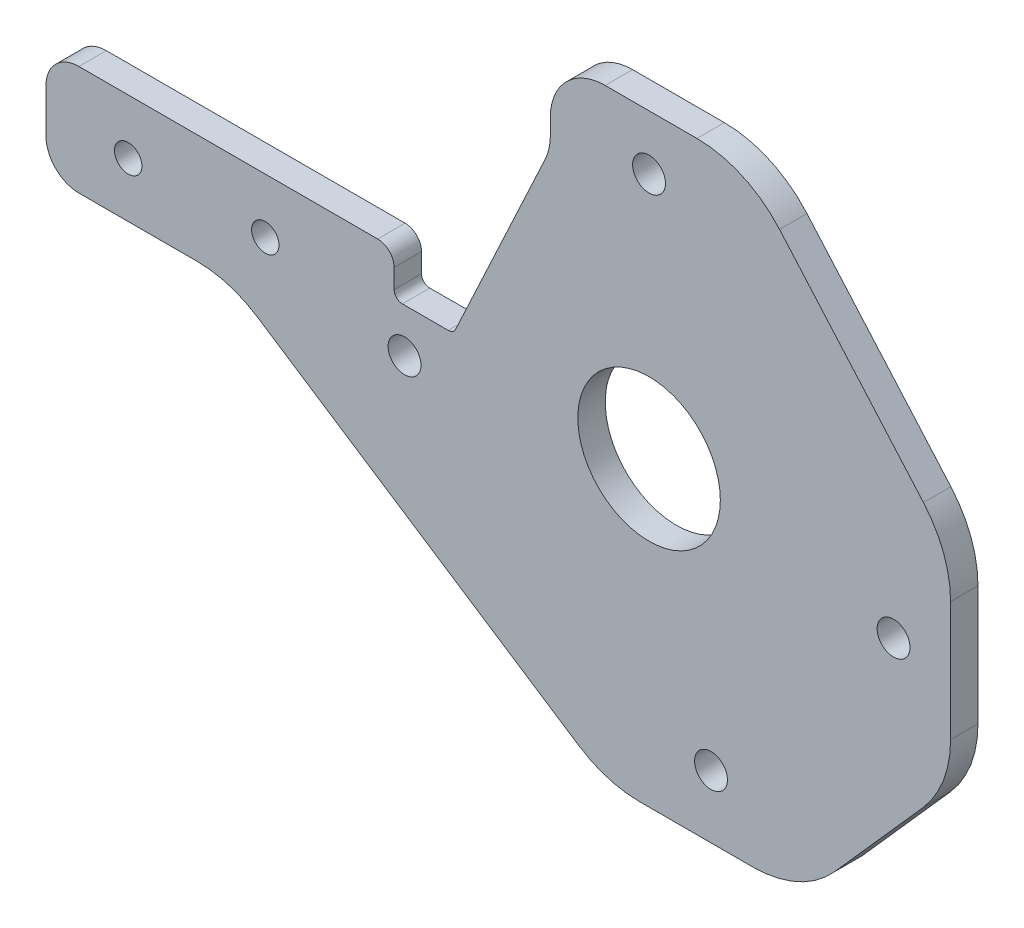
ISO-10303-21;
HEADER;
FILE_DESCRIPTION(('STEP AP214'),'2;1');
FILE_NAME('part.step','',(''),(''),'','','');
FILE_SCHEMA(('AUTOMOTIVE_DESIGN { 1 0 10303 214 1 1 1 1 }'));
ENDSEC;
DATA;
#1=APPLICATION_CONTEXT('core data for automotive mechanical design processes');
#2=APPLICATION_PROTOCOL_DEFINITION('international standard','automotive_design',2000,#1);
#3=PRODUCT_CONTEXT('',#1,'mechanical');
#4=PRODUCT('Part','Part','',(#3));
#5=PRODUCT_RELATED_PRODUCT_CATEGORY('part','',(#4));
#6=PRODUCT_DEFINITION_FORMATION('','',#4);
#7=PRODUCT_DEFINITION_CONTEXT('part definition',#1,'design');
#8=PRODUCT_DEFINITION('design','',#6,#7);
#9=PRODUCT_DEFINITION_SHAPE('','',#8);
#10=(LENGTH_UNIT() NAMED_UNIT(*) SI_UNIT(.MILLI.,.METRE.));
#11=(NAMED_UNIT(*) PLANE_ANGLE_UNIT() SI_UNIT($,.RADIAN.));
#12=(NAMED_UNIT(*) SI_UNIT($,.STERADIAN.) SOLID_ANGLE_UNIT());
#13=UNCERTAINTY_MEASURE_WITH_UNIT(LENGTH_MEASURE(1.E-05),#10,'distance_accuracy_value','');
#14=(GEOMETRIC_REPRESENTATION_CONTEXT(3) GLOBAL_UNCERTAINTY_ASSIGNED_CONTEXT((#13)) GLOBAL_UNIT_ASSIGNED_CONTEXT((#10,
#11,#12)) REPRESENTATION_CONTEXT('',''));
#15=CARTESIAN_POINT('',(0.,0.,0.));
#16=DIRECTION('',(0.,0.,1.));
#17=DIRECTION('',(1.,0.,0.));
#18=AXIS2_PLACEMENT_3D('',#15,#16,#17);
#19=CARTESIAN_POINT('',(0.,-10.,2.5));
#20=DIRECTION('',(0.,1.,0.));
#21=DIRECTION('',(0.,0.,1.));
#22=AXIS2_PLACEMENT_3D('',#19,#20,#21);
#23=PLANE('',#22);
#24=DIRECTION('',(1.,0.,0.));
#25=VECTOR('',#24,1.);
#26=CARTESIAN_POINT('',(0.,-10.,2.5));
#27=LINE('',#26,#25);
#28=CARTESIAN_POINT('',(-104.,-10.,2.5));
#29=VERTEX_POINT('',#28);
#30=CARTESIAN_POINT('',(-82.4582213056563,-10.,2.5));
#31=VERTEX_POINT('',#30);
#32=EDGE_CURVE('E297',#29,#31,#27,.T.);
#33=ORIENTED_EDGE('',*,*,#32,.F.);
#34=DIRECTION('',(0.,0.,-1.));
#35=VECTOR('',#34,1.);
#36=CARTESIAN_POINT('',(-104.,-10.,2.5));
#37=LINE('',#36,#35);
#38=CARTESIAN_POINT('',(-104.,-10.,-2.5));
#39=VERTEX_POINT('',#38);
#40=EDGE_CURVE('E403',#29,#39,#37,.T.);
#41=ORIENTED_EDGE('',*,*,#40,.T.);
#42=DIRECTION('',(1.,0.,0.));
#43=VECTOR('',#42,1.);
#44=CARTESIAN_POINT('',(0.,-10.,-2.5));
#45=LINE('',#44,#43);
#46=CARTESIAN_POINT('',(-82.4582213056563,-10.,-2.5));
#47=VERTEX_POINT('',#46);
#48=EDGE_CURVE('E330',#39,#47,#45,.T.);
#49=ORIENTED_EDGE('',*,*,#48,.T.);
#50=DIRECTION('',(0.,0.,-1.));
#51=VECTOR('',#50,1.);
#52=CARTESIAN_POINT('',(-82.4582213056563,-10.,2.5));
#53=LINE('',#52,#51);
#54=EDGE_CURVE('E340',#47,#31,#53,.F.);
#55=ORIENTED_EDGE('',*,*,#54,.T.);
#56=EDGE_LOOP('',(#33,#41,#49,#55));
#57=FACE_BOUND('',#56,.T.);
#58=ADVANCED_FACE('F39',(#57),#23,.F.);
#59=CARTESIAN_POINT('',(0.,10.,2.5));
#60=DIRECTION('',(0.,-1.,0.));
#61=DIRECTION('',(1.,0.,0.));
#62=AXIS2_PLACEMENT_3D('',#59,#60,#61);
#63=PLANE('',#62);
#64=DIRECTION('',(-1.,0.,0.));
#65=VECTOR('',#64,1.);
#66=CARTESIAN_POINT('',(0.,10.,2.5));
#67=LINE('',#66,#65);
#68=CARTESIAN_POINT('',(-49.5,10.,2.5));
#69=VERTEX_POINT('',#68);
#70=CARTESIAN_POINT('',(-104.,9.99999999999999,2.5));
#71=VERTEX_POINT('',#70);
#72=EDGE_CURVE('E292',#69,#71,#67,.T.);
#73=ORIENTED_EDGE('',*,*,#72,.F.);
#74=DIRECTION('',(0.,0.,1.));
#75=VECTOR('',#74,1.);
#76=CARTESIAN_POINT('',(-49.5,10.,2.5));
#77=LINE('',#76,#75);
#78=CARTESIAN_POINT('',(-49.5,10.,-2.5));
#79=VERTEX_POINT('',#78);
#80=EDGE_CURVE('E431',#69,#79,#77,.F.);
#81=ORIENTED_EDGE('',*,*,#80,.T.);
#82=DIRECTION('',(-1.,0.,0.));
#83=VECTOR('',#82,1.);
#84=CARTESIAN_POINT('',(0.,10.,-2.5));
#85=LINE('',#84,#83);
#86=CARTESIAN_POINT('',(-104.,9.99999999999999,-2.5));
#87=VERTEX_POINT('',#86);
#88=EDGE_CURVE('E325',#79,#87,#85,.T.);
#89=ORIENTED_EDGE('',*,*,#88,.T.);
#90=DIRECTION('',(0.,0.,-1.));
#91=VECTOR('',#90,1.);
#92=CARTESIAN_POINT('',(-104.,9.99999999999999,2.5));
#93=LINE('',#92,#91);
#94=EDGE_CURVE('E396',#87,#71,#93,.F.);
#95=ORIENTED_EDGE('',*,*,#94,.T.);
#96=EDGE_LOOP('',(#73,#81,#89,#95));
#97=FACE_BOUND('',#96,.T.);
#98=ADVANCED_FACE('F476',(#97),#63,.F.);
#99=CARTESIAN_POINT('',(-110.,0.,2.5));
#100=DIRECTION('',(1.,0.,0.));
#101=DIRECTION('',(0.,1.,0.));
#102=AXIS2_PLACEMENT_3D('',#99,#100,#101);
#103=PLANE('',#102);
#104=DIRECTION('',(0.,-1.,0.));
#105=VECTOR('',#104,1.);
#106=CARTESIAN_POINT('',(-110.,0.,2.5));
#107=LINE('',#106,#105);
#108=CARTESIAN_POINT('',(-110.,3.99999999999999,2.5));
#109=VERTEX_POINT('',#108);
#110=CARTESIAN_POINT('',(-110.,-4.00000000000001,2.5));
#111=VERTEX_POINT('',#110);
#112=EDGE_CURVE('E294',#109,#111,#107,.T.);
#113=ORIENTED_EDGE('',*,*,#112,.F.);
#114=DIRECTION('',(0.,0.,-1.));
#115=VECTOR('',#114,1.);
#116=CARTESIAN_POINT('',(-110.,3.99999999999999,2.5));
#117=LINE('',#116,#115);
#118=CARTESIAN_POINT('',(-110.,3.99999999999999,-2.5));
#119=VERTEX_POINT('',#118);
#120=EDGE_CURVE('E388',#109,#119,#117,.T.);
#121=ORIENTED_EDGE('',*,*,#120,.T.);
#122=DIRECTION('',(0.,-1.,0.));
#123=VECTOR('',#122,1.);
#124=CARTESIAN_POINT('',(-110.,0.,-2.5));
#125=LINE('',#124,#123);
#126=CARTESIAN_POINT('',(-110.,-4.00000000000001,-2.5));
#127=VERTEX_POINT('',#126);
#128=EDGE_CURVE('E327',#119,#127,#125,.T.);
#129=ORIENTED_EDGE('',*,*,#128,.T.);
#130=DIRECTION('',(0.,0.,-1.));
#131=VECTOR('',#130,1.);
#132=CARTESIAN_POINT('',(-110.,-4.00000000000001,2.5));
#133=LINE('',#132,#131);
#134=EDGE_CURVE('E386',#127,#111,#133,.F.);
#135=ORIENTED_EDGE('',*,*,#134,.T.);
#136=EDGE_LOOP('',(#113,#121,#129,#135));
#137=FACE_BOUND('',#136,.T.);
#138=ADVANCED_FACE('F485',(#137),#103,.F.);
#139=CARTESIAN_POINT('',(0.,-55.,2.5));
#140=DIRECTION('',(0.,1.,0.));
#141=DIRECTION('',(0.,0.,1.));
#142=AXIS2_PLACEMENT_3D('',#139,#140,#141);
#143=PLANE('',#142);
#144=DIRECTION('',(1.,0.,0.));
#145=VECTOR('',#144,1.);
#146=CARTESIAN_POINT('',(0.,-55.,2.5));
#147=LINE('',#146,#145);
#148=CARTESIAN_POINT('',(-1.77605476291935,-55.,2.5));
#149=VERTEX_POINT('',#148);
#150=CARTESIAN_POINT('',(18.8874431024964,-55.,2.5));
#151=VERTEX_POINT('',#150);
#152=EDGE_CURVE('E299',#149,#151,#147,.T.);
#153=ORIENTED_EDGE('',*,*,#152,.F.);
#154=DIRECTION('',(0.,0.,1.));
#155=VECTOR('',#154,1.);
#156=CARTESIAN_POINT('',(-1.77605476291935,-55.,2.5));
#157=LINE('',#156,#155);
#158=CARTESIAN_POINT('',(-1.77605476291935,-55.,-2.5));
#159=VERTEX_POINT('',#158);
#160=EDGE_CURVE('E217',#149,#159,#157,.F.);
#161=ORIENTED_EDGE('',*,*,#160,.T.);
#162=DIRECTION('',(1.,0.,0.));
#163=VECTOR('',#162,1.);
#164=CARTESIAN_POINT('',(0.,-55.,-2.5));
#165=LINE('',#164,#163);
#166=CARTESIAN_POINT('',(18.8874431024964,-55.,-2.5));
#167=VERTEX_POINT('',#166);
#168=EDGE_CURVE('E332',#159,#167,#165,.T.);
#169=ORIENTED_EDGE('',*,*,#168,.T.);
#170=DIRECTION('',(0.,0.,1.));
#171=VECTOR('',#170,1.);
#172=CARTESIAN_POINT('',(18.8874431024964,-55.,2.5));
#173=LINE('',#172,#171);
#174=EDGE_CURVE('E221',#167,#151,#173,.T.);
#175=ORIENTED_EDGE('',*,*,#174,.T.);
#176=EDGE_LOOP('',(#153,#161,#169,#175));
#177=FACE_BOUND('',#176,.T.);
#178=ADVANCED_FACE('F501',(#177),#143,.F.);
#179=CARTESIAN_POINT('',(55.,0.,2.5));
#180=DIRECTION('',(-1.,0.,0.));
#181=DIRECTION('',(0.,0.,1.));
#182=AXIS2_PLACEMENT_3D('',#179,#180,#181);
#183=PLANE('',#182);
#184=DIRECTION('',(0.,1.,0.));
#185=VECTOR('',#184,1.);
#186=CARTESIAN_POINT('',(55.,0.,2.5));
#187=LINE('',#186,#185);
#188=CARTESIAN_POINT('',(55.,-16.8261267667128,2.5));
#189=VERTEX_POINT('',#188);
#190=CARTESIAN_POINT('',(55.,4.97596875721935,2.5));
#191=VERTEX_POINT('',#190);
#192=EDGE_CURVE('E301',#189,#191,#187,.T.);
#193=ORIENTED_EDGE('',*,*,#192,.F.);
#194=DIRECTION('',(0.,0.,1.));
#195=VECTOR('',#194,1.);
#196=CARTESIAN_POINT('',(55.,-16.8261267667128,2.5));
#197=LINE('',#196,#195);
#198=CARTESIAN_POINT('',(55.,-16.8261267667128,-2.5));
#199=VERTEX_POINT('',#198);
#200=EDGE_CURVE('E372',#189,#199,#197,.F.);
#201=ORIENTED_EDGE('',*,*,#200,.T.);
#202=DIRECTION('',(0.,1.,0.));
#203=VECTOR('',#202,1.);
#204=CARTESIAN_POINT('',(55.,0.,-2.5));
#205=LINE('',#204,#203);
#206=CARTESIAN_POINT('',(55.,4.97596875721935,-2.5));
#207=VERTEX_POINT('',#206);
#208=EDGE_CURVE('E335',#199,#207,#205,.T.);
#209=ORIENTED_EDGE('',*,*,#208,.T.);
#210=DIRECTION('',(0.,0.,1.));
#211=VECTOR('',#210,1.);
#212=CARTESIAN_POINT('',(55.,4.97596875721935,2.5));
#213=LINE('',#212,#211);
#214=EDGE_CURVE('E369',#207,#191,#213,.T.);
#215=ORIENTED_EDGE('',*,*,#214,.T.);
#216=EDGE_LOOP('',(#193,#201,#209,#215));
#217=FACE_BOUND('',#216,.T.);
#218=ADVANCED_FACE('F530',(#217),#183,.F.);
#219=CARTESIAN_POINT('',(0.,44.9999999999999,2.5));
#220=DIRECTION('',(0.,0.,-1.));
#221=DIRECTION('',(-1.,0.,0.));
#222=AXIS2_PLACEMENT_3D('',#219,#220,#221);
#223=CYLINDRICAL_SURFACE('',#222,3.00000000000001);
#224=CARTESIAN_POINT('',(0.,44.9999999999999,2.5));
#225=DIRECTION('',(0.,0.,1.));
#226=DIRECTION('',(1.,0.,0.));
#227=AXIS2_PLACEMENT_3D('',#224,#225,#226);
#228=CIRCLE('',#227,3.00000000000001);
#229=CARTESIAN_POINT('',(3.00000000000001,44.9999999999999,2.5));
#230=VERTEX_POINT('',#229);
#231=EDGE_CURVE('E289',#230,#230,#228,.T.);
#232=ORIENTED_EDGE('',*,*,#231,.T.);
#233=EDGE_LOOP('',(#232));
#234=FACE_BOUND('',#233,.T.);
#235=CARTESIAN_POINT('',(0.,44.9999999999999,-2.5));
#236=DIRECTION('',(0.,0.,1.));
#237=DIRECTION('',(1.,0.,0.));
#238=AXIS2_PLACEMENT_3D('',#235,#236,#237);
#239=CIRCLE('',#238,3.00000000000001);
#240=CARTESIAN_POINT('',(3.00000000000001,44.9999999999999,-2.5));
#241=VERTEX_POINT('',#240);
#242=EDGE_CURVE('E322',#241,#241,#239,.T.);
#243=ORIENTED_EDGE('',*,*,#242,.F.);
#244=EDGE_LOOP('',(#243));
#245=FACE_BOUND('',#244,.T.);
#246=ADVANCED_FACE('F554',(#234,#245),#223,.F.);
#247=CARTESIAN_POINT('',(-44.5982062419555,-6.00000000000005,2.5));
#248=DIRECTION('',(0.,0.,-1.));
#249=DIRECTION('',(-1.,0.,0.));
#250=AXIS2_PLACEMENT_3D('',#247,#248,#249);
#251=CYLINDRICAL_SURFACE('',#250,2.99999999999999);
#252=CARTESIAN_POINT('',(-44.5982062419555,-6.00000000000005,2.5));
#253=DIRECTION('',(0.,0.,1.));
#254=DIRECTION('',(1.,0.,0.));
#255=AXIS2_PLACEMENT_3D('',#252,#253,#254);
#256=CIRCLE('',#255,2.99999999999999);
#257=CARTESIAN_POINT('',(-41.5982062419555,-6.00000000000005,2.5));
#258=VERTEX_POINT('',#257);
#259=EDGE_CURVE('E286',#258,#258,#256,.T.);
#260=ORIENTED_EDGE('',*,*,#259,.T.);
#261=EDGE_LOOP('',(#260));
#262=FACE_BOUND('',#261,.T.);
#263=CARTESIAN_POINT('',(-44.5982062419555,-6.00000000000005,-2.5));
#264=DIRECTION('',(0.,0.,1.));
#265=DIRECTION('',(1.,0.,0.));
#266=AXIS2_PLACEMENT_3D('',#263,#264,#265);
#267=CIRCLE('',#266,2.99999999999999);
#268=CARTESIAN_POINT('',(-41.5982062419555,-6.00000000000005,-2.5));
#269=VERTEX_POINT('',#268);
#270=EDGE_CURVE('E319',#269,#269,#267,.T.);
#271=ORIENTED_EDGE('',*,*,#270,.F.);
#272=EDGE_LOOP('',(#271));
#273=FACE_BOUND('',#272,.T.);
#274=ADVANCED_FACE('F557',(#262,#273),#251,.F.);
#275=CARTESIAN_POINT('',(44.5982062419555,-6.00000000000005,2.5));
#276=DIRECTION('',(0.,0.,-1.));
#277=DIRECTION('',(-1.,0.,0.));
#278=AXIS2_PLACEMENT_3D('',#275,#276,#277);
#279=CYLINDRICAL_SURFACE('',#278,3.);
#280=CARTESIAN_POINT('',(44.5982062419555,-6.00000000000005,2.5));
#281=DIRECTION('',(0.,0.,1.));
#282=DIRECTION('',(1.,0.,0.));
#283=AXIS2_PLACEMENT_3D('',#280,#281,#282);
#284=CIRCLE('',#283,3.);
#285=CARTESIAN_POINT('',(47.5982062419555,-6.00000000000005,2.5));
#286=VERTEX_POINT('',#285);
#287=EDGE_CURVE('E283',#286,#286,#284,.T.);
#288=ORIENTED_EDGE('',*,*,#287,.T.);
#289=EDGE_LOOP('',(#288));
#290=FACE_BOUND('',#289,.T.);
#291=CARTESIAN_POINT('',(44.5982062419555,-6.00000000000005,-2.5));
#292=DIRECTION('',(0.,0.,1.));
#293=DIRECTION('',(1.,0.,0.));
#294=AXIS2_PLACEMENT_3D('',#291,#292,#293);
#295=CIRCLE('',#294,3.);
#296=CARTESIAN_POINT('',(47.5982062419555,-6.00000000000005,-2.5));
#297=VERTEX_POINT('',#296);
#298=EDGE_CURVE('E316',#297,#297,#295,.T.);
#299=ORIENTED_EDGE('',*,*,#298,.F.);
#300=EDGE_LOOP('',(#299));
#301=FACE_BOUND('',#300,.T.);
#302=ADVANCED_FACE('F561',(#290,#301),#279,.F.);
#303=CARTESIAN_POINT('',(11.3,-43.5581220899157,2.5));
#304=DIRECTION('',(0.,0.,-1.));
#305=DIRECTION('',(-1.,0.,0.));
#306=AXIS2_PLACEMENT_3D('',#303,#304,#305);
#307=CYLINDRICAL_SURFACE('',#306,3.00000000000001);
#308=CARTESIAN_POINT('',(11.3,-43.5581220899157,2.5));
#309=DIRECTION('',(0.,0.,1.));
#310=DIRECTION('',(1.,0.,0.));
#311=AXIS2_PLACEMENT_3D('',#308,#309,#310);
#312=CIRCLE('',#311,3.00000000000001);
#313=CARTESIAN_POINT('',(14.3,-43.5581220899157,2.5));
#314=VERTEX_POINT('',#313);
#315=EDGE_CURVE('E280',#314,#314,#312,.T.);
#316=ORIENTED_EDGE('',*,*,#315,.T.);
#317=EDGE_LOOP('',(#316));
#318=FACE_BOUND('',#317,.T.);
#319=CARTESIAN_POINT('',(11.3,-43.5581220899157,-2.5));
#320=DIRECTION('',(0.,0.,1.));
#321=DIRECTION('',(1.,0.,0.));
#322=AXIS2_PLACEMENT_3D('',#319,#320,#321);
#323=CIRCLE('',#322,3.00000000000001);
#324=CARTESIAN_POINT('',(14.3,-43.5581220899157,-2.5));
#325=VERTEX_POINT('',#324);
#326=EDGE_CURVE('E313',#325,#325,#323,.T.);
#327=ORIENTED_EDGE('',*,*,#326,.F.);
#328=EDGE_LOOP('',(#327));
#329=FACE_BOUND('',#328,.T.);
#330=ADVANCED_FACE('F565',(#318,#329),#307,.F.);
#331=CARTESIAN_POINT('',(0.,0.,2.5));
#332=DIRECTION('',(0.,0.,-1.));
#333=DIRECTION('',(-1.,0.,0.));
#334=AXIS2_PLACEMENT_3D('',#331,#332,#333);
#335=CYLINDRICAL_SURFACE('',#334,13.);
#336=CARTESIAN_POINT('',(0.,0.,2.5));
#337=DIRECTION('',(0.,0.,1.));
#338=DIRECTION('',(1.,0.,0.));
#339=AXIS2_PLACEMENT_3D('',#336,#337,#338);
#340=CIRCLE('',#339,13.);
#341=CARTESIAN_POINT('',(13.,0.,2.5));
#342=VERTEX_POINT('',#341);
#343=EDGE_CURVE('E277',#342,#342,#340,.T.);
#344=ORIENTED_EDGE('',*,*,#343,.T.);
#345=EDGE_LOOP('',(#344));
#346=FACE_BOUND('',#345,.T.);
#347=CARTESIAN_POINT('',(0.,0.,-2.5));
#348=DIRECTION('',(0.,0.,1.));
#349=DIRECTION('',(1.,0.,0.));
#350=AXIS2_PLACEMENT_3D('',#347,#348,#349);
#351=CIRCLE('',#350,13.);
#352=CARTESIAN_POINT('',(13.,0.,-2.5));
#353=VERTEX_POINT('',#352);
#354=EDGE_CURVE('E310',#353,#353,#351,.T.);
#355=ORIENTED_EDGE('',*,*,#354,.F.);
#356=EDGE_LOOP('',(#355));
#357=FACE_BOUND('',#356,.T.);
#358=ADVANCED_FACE('F569',(#346,#357),#335,.F.);
#359=CARTESIAN_POINT('',(-95.,0.,2.5));
#360=DIRECTION('',(0.,0.,-1.));
#361=DIRECTION('',(-1.,0.,0.));
#362=AXIS2_PLACEMENT_3D('',#359,#360,#361);
#363=CYLINDRICAL_SURFACE('',#362,2.50000000000001);
#364=CARTESIAN_POINT('',(-95.,0.,2.5));
#365=DIRECTION('',(0.,0.,1.));
#366=DIRECTION('',(1.,0.,0.));
#367=AXIS2_PLACEMENT_3D('',#364,#365,#366);
#368=CIRCLE('',#367,2.50000000000001);
#369=CARTESIAN_POINT('',(-92.5,0.,2.5));
#370=VERTEX_POINT('',#369);
#371=EDGE_CURVE('E273',#370,#370,#368,.T.);
#372=ORIENTED_EDGE('',*,*,#371,.T.);
#373=EDGE_LOOP('',(#372));
#374=FACE_BOUND('',#373,.T.);
#375=CARTESIAN_POINT('',(-95.,0.,-2.5));
#376=DIRECTION('',(0.,0.,1.));
#377=DIRECTION('',(1.,0.,0.));
#378=AXIS2_PLACEMENT_3D('',#375,#376,#377);
#379=CIRCLE('',#378,2.50000000000001);
#380=CARTESIAN_POINT('',(-92.5,0.,-2.5));
#381=VERTEX_POINT('',#380);
#382=EDGE_CURVE('E307',#381,#381,#379,.T.);
#383=ORIENTED_EDGE('',*,*,#382,.F.);
#384=EDGE_LOOP('',(#383));
#385=FACE_BOUND('',#384,.T.);
#386=ADVANCED_FACE('F573',(#374,#385),#363,.F.);
#387=CARTESIAN_POINT('',(-70.,0.,2.5));
#388=DIRECTION('',(0.,0.,-1.));
#389=DIRECTION('',(-1.,0.,0.));
#390=AXIS2_PLACEMENT_3D('',#387,#388,#389);
#391=CYLINDRICAL_SURFACE('',#390,2.5);
#392=CARTESIAN_POINT('',(-70.,0.,2.5));
#393=DIRECTION('',(0.,0.,1.));
#394=DIRECTION('',(1.,0.,0.));
#395=AXIS2_PLACEMENT_3D('',#392,#393,#394);
#396=CIRCLE('',#395,2.5);
#397=CARTESIAN_POINT('',(-67.5,0.,2.5));
#398=VERTEX_POINT('',#397);
#399=EDGE_CURVE('E270',#398,#398,#396,.T.);
#400=ORIENTED_EDGE('',*,*,#399,.T.);
#401=EDGE_LOOP('',(#400));
#402=FACE_BOUND('',#401,.T.);
#403=CARTESIAN_POINT('',(-70.,0.,-2.5));
#404=DIRECTION('',(0.,0.,1.));
#405=DIRECTION('',(1.,0.,0.));
#406=AXIS2_PLACEMENT_3D('',#403,#404,#405);
#407=CIRCLE('',#406,2.5);
#408=CARTESIAN_POINT('',(-67.5,0.,-2.5));
#409=VERTEX_POINT('',#408);
#410=EDGE_CURVE('E269',#409,#409,#407,.T.);
#411=ORIENTED_EDGE('',*,*,#410,.F.);
#412=EDGE_LOOP('',(#411));
#413=FACE_BOUND('',#412,.T.);
#414=ADVANCED_FACE('F577',(#402,#413),#391,.F.);
#415=CARTESIAN_POINT('',(0.,55.,2.5));
#416=DIRECTION('',(0.,1.,0.));
#417=DIRECTION('',(-1.,0.,0.));
#418=AXIS2_PLACEMENT_3D('',#415,#416,#417);
#419=PLANE('',#418);
#420=DIRECTION('',(1.,0.,0.));
#421=VECTOR('',#420,1.);
#422=CARTESIAN_POINT('',(0.,55.,-2.5));
#423=LINE('',#422,#421);
#424=CARTESIAN_POINT('',(-8.,55.,-2.5));
#425=VERTEX_POINT('',#424);
#426=CARTESIAN_POINT('',(8.74474632195203,55.,-2.5));
#427=VERTEX_POINT('',#426);
#428=EDGE_CURVE('E274',#425,#427,#423,.T.);
#429=ORIENTED_EDGE('',*,*,#428,.F.);
#430=DIRECTION('',(0.,0.,1.));
#431=VECTOR('',#430,1.);
#432=CARTESIAN_POINT('',(-8.,55.,2.5));
#433=LINE('',#432,#431);
#434=CARTESIAN_POINT('',(-8.,55.,2.5));
#435=VERTEX_POINT('',#434);
#436=EDGE_CURVE('E414',#425,#435,#433,.T.);
#437=ORIENTED_EDGE('',*,*,#436,.T.);
#438=DIRECTION('',(1.,0.,0.));
#439=VECTOR('',#438,1.);
#440=CARTESIAN_POINT('',(0.,55.,2.5));
#441=LINE('',#440,#439);
#442=CARTESIAN_POINT('',(8.74474632195203,55.,2.5));
#443=VERTEX_POINT('',#442);
#444=EDGE_CURVE('E234',#435,#443,#441,.T.);
#445=ORIENTED_EDGE('',*,*,#444,.T.);
#446=DIRECTION('',(0.,0.,1.));
#447=VECTOR('',#446,1.);
#448=CARTESIAN_POINT('',(8.74474632195203,55.,-2.5));
#449=LINE('',#448,#447);
#450=EDGE_CURVE('E379',#443,#427,#449,.F.);
#451=ORIENTED_EDGE('',*,*,#450,.T.);
#452=EDGE_LOOP('',(#429,#437,#445,#451));
#453=FACE_BOUND('',#452,.T.);
#454=ADVANCED_FACE('F581',(#453),#419,.T.);
#455=CARTESIAN_POINT('',(0.,0.,2.5));
#456=DIRECTION('',(0.,0.,1.));
#457=DIRECTION('',(1.,0.,0.));
#458=AXIS2_PLACEMENT_3D('',#455,#456,#457);
#459=PLANE('',#458);
#460=DIRECTION('',(0.,-1.,0.));
#461=VECTOR('',#460,1.);
#462=CARTESIAN_POINT('',(-46.5,10.,2.5));
#463=LINE('',#462,#461);
#464=CARTESIAN_POINT('',(-46.5,7.,2.5));
#465=VERTEX_POINT('',#464);
#466=CARTESIAN_POINT('',(-46.5,3.5,2.5));
#467=VERTEX_POINT('',#466);
#468=EDGE_CURVE('E248',#465,#467,#463,.T.);
#469=ORIENTED_EDGE('',*,*,#468,.F.);
#470=CARTESIAN_POINT('',(-49.5,7.,2.5));
#471=DIRECTION('',(0.,0.,1.));
#472=DIRECTION('',(1.,0.,0.));
#473=AXIS2_PLACEMENT_3D('',#470,#471,#472);
#474=CIRCLE('',#473,3.);
#475=EDGE_CURVE('E429',#465,#69,#474,.T.);
#476=ORIENTED_EDGE('',*,*,#475,.T.);
#477=ORIENTED_EDGE('',*,*,#72,.T.);
#478=CARTESIAN_POINT('',(-104.,3.99999999999999,2.5));
#479=DIRECTION('',(0.,0.,1.));
#480=DIRECTION('',(1.,0.,0.));
#481=AXIS2_PLACEMENT_3D('',#478,#479,#480);
#482=CIRCLE('',#481,6.);
#483=EDGE_CURVE('E401',#71,#109,#482,.T.);
#484=ORIENTED_EDGE('',*,*,#483,.T.);
#485=ORIENTED_EDGE('',*,*,#112,.T.);
#486=CARTESIAN_POINT('',(-104.,-4.00000000000002,2.5));
#487=DIRECTION('',(0.,0.,1.));
#488=DIRECTION('',(1.,0.,0.));
#489=AXIS2_PLACEMENT_3D('',#486,#487,#488);
#490=CIRCLE('',#489,6.);
#491=EDGE_CURVE('E399',#111,#29,#490,.T.);
#492=ORIENTED_EDGE('',*,*,#491,.T.);
#493=ORIENTED_EDGE('',*,*,#32,.T.);
#494=CARTESIAN_POINT('',(-82.4582213056563,-30.,2.5));
#495=DIRECTION('',(0.,0.,1.));
#496=DIRECTION('',(1.,0.,0.));
#497=AXIS2_PLACEMENT_3D('',#494,#495,#496);
#498=CIRCLE('',#497,20.);
#499=CARTESIAN_POINT('',(-71.5057098778198,-13.2655297836139,2.5));
#500=VERTEX_POINT('',#499);
#501=EDGE_CURVE('E239',#31,#500,#498,.F.);
#502=ORIENTED_EDGE('',*,*,#501,.T.);
#503=DIRECTION('',(-0.836723510819302,0.547625571391823,0.));
#504=VECTOR('',#503,1.);
#505=CARTESIAN_POINT('',(-7.73912506899439,-55.,2.5));
#506=LINE('',#505,#504);
#507=CARTESIAN_POINT('',(-12.7285661907558,-51.7344702163861,2.5));
#508=VERTEX_POINT('',#507);
#509=EDGE_CURVE('E229',#508,#500,#506,.T.);
#510=ORIENTED_EDGE('',*,*,#509,.F.);
#511=CARTESIAN_POINT('',(-1.77605476291935,-35.,2.5));
#512=DIRECTION('',(0.,0.,1.));
#513=DIRECTION('',(1.,0.,0.));
#514=AXIS2_PLACEMENT_3D('',#511,#512,#513);
#515=CIRCLE('',#514,20.);
#516=EDGE_CURVE('E212',#508,#149,#515,.T.);
#517=ORIENTED_EDGE('',*,*,#516,.T.);
#518=ORIENTED_EDGE('',*,*,#152,.T.);
#519=CARTESIAN_POINT('',(18.8874431024964,-35.,2.5));
#520=DIRECTION('',(0.,0.,1.));
#521=DIRECTION('',(1.,0.,0.));
#522=AXIS2_PLACEMENT_3D('',#519,#520,#521);
#523=CIRCLE('',#522,20.);
#524=CARTESIAN_POINT('',(33.8527890740685,-48.2679470887983,2.5));
#525=VERTEX_POINT('',#524);
#526=EDGE_CURVE('E222',#151,#525,#523,.T.);
#527=ORIENTED_EDGE('',*,*,#526,.T.);
#528=DIRECTION('',(-0.663397354439913,-0.748267298578606,0.));
#529=VECTOR('',#528,1.);
#530=CARTESIAN_POINT('',(55.,-24.4153249972039,2.5));
#531=LINE('',#530,#529);
#532=CARTESIAN_POINT('',(49.9653459715721,-30.094073855511,2.5));
#533=VERTEX_POINT('',#532);
#534=EDGE_CURVE('E243',#533,#525,#531,.T.);
#535=ORIENTED_EDGE('',*,*,#534,.F.);
#536=CARTESIAN_POINT('',(35.,-16.8261267667128,2.5));
#537=DIRECTION('',(0.,0.,1.));
#538=DIRECTION('',(1.,0.,0.));
#539=AXIS2_PLACEMENT_3D('',#536,#537,#538);
#540=CIRCLE('',#539,20.);
#541=EDGE_CURVE('E348',#533,#189,#540,.T.);
#542=ORIENTED_EDGE('',*,*,#541,.T.);
#543=ORIENTED_EDGE('',*,*,#192,.T.);
#544=CARTESIAN_POINT('',(35.,4.97596875721935,2.5));
#545=DIRECTION('',(0.,0.,1.));
#546=DIRECTION('',(1.,0.,0.));
#547=AXIS2_PLACEMENT_3D('',#544,#545,#546);
#548=CIRCLE('',#547,20.);
#549=CARTESIAN_POINT('',(50.0554530541816,18.141580529307,2.5));
#550=VERTEX_POINT('',#549);
#551=EDGE_CURVE('E346',#191,#550,#548,.T.);
#552=ORIENTED_EDGE('',*,*,#551,.T.);
#553=DIRECTION('',(0.658280588604383,-0.752772652709081,0.));
#554=VECTOR('',#553,1.);
#555=CARTESIAN_POINT('',(17.8237002442508,55.,2.5));
#556=LINE('',#555,#554);
#557=CARTESIAN_POINT('',(23.8001993761337,48.1656117720876,2.5));
#558=VERTEX_POINT('',#557);
#559=EDGE_CURVE('E251',#558,#550,#556,.T.);
#560=ORIENTED_EDGE('',*,*,#559,.F.);
#561=CARTESIAN_POINT('',(8.74474632195203,35.,2.5));
#562=DIRECTION('',(0.,0.,1.));
#563=DIRECTION('',(1.,0.,0.));
#564=AXIS2_PLACEMENT_3D('',#561,#562,#563);
#565=CIRCLE('',#564,20.);
#566=EDGE_CURVE('E343',#558,#443,#565,.T.);
#567=ORIENTED_EDGE('',*,*,#566,.T.);
#568=ORIENTED_EDGE('',*,*,#444,.F.);
#569=CARTESIAN_POINT('',(-8.,45.,2.5));
#570=DIRECTION('',(0.,0.,1.));
#571=DIRECTION('',(1.,0.,0.));
#572=AXIS2_PLACEMENT_3D('',#569,#570,#571);
#573=CIRCLE('',#572,10.);
#574=CARTESIAN_POINT('',(-18.,45.,2.5));
#575=VERTEX_POINT('',#574);
#576=EDGE_CURVE('E417',#435,#575,#573,.T.);
#577=ORIENTED_EDGE('',*,*,#576,.T.);
#578=DIRECTION('',(0.,1.,0.));
#579=VECTOR('',#578,1.);
#580=CARTESIAN_POINT('',(-18.,55.,2.5));
#581=LINE('',#580,#579);
#582=CARTESIAN_POINT('',(-18.,42.1224905017404,2.5));
#583=VERTEX_POINT('',#582);
#584=EDGE_CURVE('E256',#583,#575,#581,.T.);
#585=ORIENTED_EDGE('',*,*,#584,.F.);
#586=CARTESIAN_POINT('',(-28.,42.1224905017404,2.5));
#587=DIRECTION('',(0.,0.,1.));
#588=DIRECTION('',(1.,0.,0.));
#589=AXIS2_PLACEMENT_3D('',#586,#587,#588);
#590=CIRCLE('',#589,10.);
#591=CARTESIAN_POINT('',(-18.9369221296335,37.8963078843334,2.5));
#592=VERTEX_POINT('',#591);
#593=EDGE_CURVE('E421',#583,#592,#590,.F.);
#594=ORIENTED_EDGE('',*,*,#593,.T.);
#595=DIRECTION('',(0.422618261740697,0.906307787036651,0.));
#596=VECTOR('',#595,1.);
#597=CARTESIAN_POINT('',(-18.,39.905543875311,2.5));
#598=LINE('',#597,#596);
#599=CARTESIAN_POINT('',(-35.271789106244,2.86607260738896,2.5));
#600=VERTEX_POINT('',#599);
#601=EDGE_CURVE('E254',#600,#592,#598,.T.);
#602=ORIENTED_EDGE('',*,*,#601,.F.);
#603=CARTESIAN_POINT('',(-36.6312507867989,3.5,2.5));
#604=DIRECTION('',(0.,0.,1.));
#605=DIRECTION('',(1.,0.,0.));
#606=AXIS2_PLACEMENT_3D('',#603,#604,#605);
#607=CIRCLE('',#606,1.5);
#608=CARTESIAN_POINT('',(-36.6312507867989,2.,2.5));
#609=VERTEX_POINT('',#608);
#610=EDGE_CURVE('E444',#600,#609,#607,.F.);
#611=ORIENTED_EDGE('',*,*,#610,.T.);
#612=DIRECTION('',(1.,0.,0.));
#613=VECTOR('',#612,1.);
#614=CARTESIAN_POINT('',(-35.6756453955877,2.,2.5));
#615=LINE('',#614,#613);
#616=CARTESIAN_POINT('',(-45.,2.,2.5));
#617=VERTEX_POINT('',#616);
#618=EDGE_CURVE('E250',#617,#609,#615,.T.);
#619=ORIENTED_EDGE('',*,*,#618,.F.);
#620=CARTESIAN_POINT('',(-45.,3.5,2.5));
#621=DIRECTION('',(0.,0.,1.));
#622=DIRECTION('',(1.,0.,0.));
#623=AXIS2_PLACEMENT_3D('',#620,#621,#622);
#624=CIRCLE('',#623,1.5);
#625=EDGE_CURVE('E47',#617,#467,#624,.F.);
#626=ORIENTED_EDGE('',*,*,#625,.T.);
#627=EDGE_LOOP('',(#469,#476,#477,#484,#485,#492,#493,#502,#510,#517,#518,#527,#535,#542,#543,
#552,#560,#567,#568,#577,#585,#594,#602,#611,#619,#626));
#628=FACE_BOUND('',#627,.T.);
#629=ORIENTED_EDGE('',*,*,#399,.F.);
#630=EDGE_LOOP('',(#629));
#631=FACE_BOUND('',#630,.T.);
#632=ORIENTED_EDGE('',*,*,#371,.F.);
#633=EDGE_LOOP('',(#632));
#634=FACE_BOUND('',#633,.T.);
#635=ORIENTED_EDGE('',*,*,#343,.F.);
#636=EDGE_LOOP('',(#635));
#637=FACE_BOUND('',#636,.T.);
#638=ORIENTED_EDGE('',*,*,#315,.F.);
#639=EDGE_LOOP('',(#638));
#640=FACE_BOUND('',#639,.T.);
#641=ORIENTED_EDGE('',*,*,#287,.F.);
#642=EDGE_LOOP('',(#641));
#643=FACE_BOUND('',#642,.T.);
#644=ORIENTED_EDGE('',*,*,#259,.F.);
#645=EDGE_LOOP('',(#644));
#646=FACE_BOUND('',#645,.T.);
#647=ORIENTED_EDGE('',*,*,#231,.F.);
#648=EDGE_LOOP('',(#647));
#649=FACE_BOUND('',#648,.T.);
#650=ADVANCED_FACE('F236',(#628,#631,#634,#637,#640,#643,#646,#649),#459,.T.);
#651=CARTESIAN_POINT('',(0.,0.,-2.5));
#652=DIRECTION('',(0.,0.,1.));
#653=DIRECTION('',(1.,0.,0.));
#654=AXIS2_PLACEMENT_3D('',#651,#652,#653);
#655=PLANE('',#654);
#656=ORIENTED_EDGE('',*,*,#88,.F.);
#657=CARTESIAN_POINT('',(-49.5,7.,-2.5));
#658=DIRECTION('',(0.,0.,1.));
#659=DIRECTION('',(1.,0.,0.));
#660=AXIS2_PLACEMENT_3D('',#657,#658,#659);
#661=CIRCLE('',#660,3.);
#662=CARTESIAN_POINT('',(-46.5,7.,-2.5));
#663=VERTEX_POINT('',#662);
#664=EDGE_CURVE('E433',#79,#663,#661,.F.);
#665=ORIENTED_EDGE('',*,*,#664,.T.);
#666=DIRECTION('',(0.,-1.,0.));
#667=VECTOR('',#666,1.);
#668=CARTESIAN_POINT('',(-46.5,10.,-2.5));
#669=LINE('',#668,#667);
#670=CARTESIAN_POINT('',(-46.5,3.5,-2.5));
#671=VERTEX_POINT('',#670);
#672=EDGE_CURVE('E259',#663,#671,#669,.T.);
#673=ORIENTED_EDGE('',*,*,#672,.T.);
#674=CARTESIAN_POINT('',(-45.,3.5,-2.5));
#675=DIRECTION('',(0.,0.,1.));
#676=DIRECTION('',(1.,0.,0.));
#677=AXIS2_PLACEMENT_3D('',#674,#675,#676);
#678=CIRCLE('',#677,1.5);
#679=CARTESIAN_POINT('',(-45.,2.,-2.5));
#680=VERTEX_POINT('',#679);
#681=EDGE_CURVE('E11',#671,#680,#678,.T.);
#682=ORIENTED_EDGE('',*,*,#681,.T.);
#683=DIRECTION('',(1.,0.,0.));
#684=VECTOR('',#683,1.);
#685=CARTESIAN_POINT('',(-35.6756453955877,2.,-2.5));
#686=LINE('',#685,#684);
#687=CARTESIAN_POINT('',(-36.6312507867989,2.,-2.5));
#688=VERTEX_POINT('',#687);
#689=EDGE_CURVE('E261',#680,#688,#686,.T.);
#690=ORIENTED_EDGE('',*,*,#689,.T.);
#691=CARTESIAN_POINT('',(-36.6312507867989,3.5,-2.5));
#692=DIRECTION('',(0.,0.,1.));
#693=DIRECTION('',(1.,0.,0.));
#694=AXIS2_PLACEMENT_3D('',#691,#692,#693);
#695=CIRCLE('',#694,1.5);
#696=CARTESIAN_POINT('',(-35.271789106244,2.86607260738896,-2.5));
#697=VERTEX_POINT('',#696);
#698=EDGE_CURVE('E446',#688,#697,#695,.T.);
#699=ORIENTED_EDGE('',*,*,#698,.T.);
#700=DIRECTION('',(0.422618261740697,0.906307787036651,0.));
#701=VECTOR('',#700,1.);
#702=CARTESIAN_POINT('',(-18.,39.905543875311,-2.5));
#703=LINE('',#702,#701);
#704=CARTESIAN_POINT('',(-18.9369221296335,37.8963078843334,-2.5));
#705=VERTEX_POINT('',#704);
#706=EDGE_CURVE('E264',#697,#705,#703,.T.);
#707=ORIENTED_EDGE('',*,*,#706,.T.);
#708=CARTESIAN_POINT('',(-28.,42.1224905017404,-2.5));
#709=DIRECTION('',(0.,0.,1.));
#710=DIRECTION('',(1.,0.,0.));
#711=AXIS2_PLACEMENT_3D('',#708,#709,#710);
#712=CIRCLE('',#711,10.);
#713=CARTESIAN_POINT('',(-18.,42.1224905017404,-2.5));
#714=VERTEX_POINT('',#713);
#715=EDGE_CURVE('E424',#705,#714,#712,.T.);
#716=ORIENTED_EDGE('',*,*,#715,.T.);
#717=DIRECTION('',(0.,1.,0.));
#718=VECTOR('',#717,1.);
#719=CARTESIAN_POINT('',(-18.,55.,-2.5));
#720=LINE('',#719,#718);
#721=CARTESIAN_POINT('',(-18.,45.,-2.5));
#722=VERTEX_POINT('',#721);
#723=EDGE_CURVE('E266',#714,#722,#720,.T.);
#724=ORIENTED_EDGE('',*,*,#723,.T.);
#725=CARTESIAN_POINT('',(-8.,45.,-2.5));
#726=DIRECTION('',(0.,0.,1.));
#727=DIRECTION('',(1.,0.,0.));
#728=AXIS2_PLACEMENT_3D('',#725,#726,#727);
#729=CIRCLE('',#728,10.);
#730=EDGE_CURVE('E419',#722,#425,#729,.F.);
#731=ORIENTED_EDGE('',*,*,#730,.T.);
#732=ORIENTED_EDGE('',*,*,#428,.T.);
#733=CARTESIAN_POINT('',(8.74474632195203,35.,-2.5));
#734=DIRECTION('',(0.,0.,1.));
#735=DIRECTION('',(1.,0.,0.));
#736=AXIS2_PLACEMENT_3D('',#733,#734,#735);
#737=CIRCLE('',#736,20.);
#738=CARTESIAN_POINT('',(23.8001993761337,48.1656117720876,-2.5));
#739=VERTEX_POINT('',#738);
#740=EDGE_CURVE('E354',#427,#739,#737,.F.);
#741=ORIENTED_EDGE('',*,*,#740,.T.);
#742=DIRECTION('',(0.658280588604383,-0.752772652709081,0.));
#743=VECTOR('',#742,1.);
#744=CARTESIAN_POINT('',(17.8237002442508,55.,-2.5));
#745=LINE('',#744,#743);
#746=CARTESIAN_POINT('',(50.0554530541816,18.141580529307,-2.5));
#747=VERTEX_POINT('',#746);
#748=EDGE_CURVE('E511',#739,#747,#745,.T.);
#749=ORIENTED_EDGE('',*,*,#748,.T.);
#750=CARTESIAN_POINT('',(35.,4.97596875721935,-2.5));
#751=DIRECTION('',(0.,0.,1.));
#752=DIRECTION('',(1.,0.,0.));
#753=AXIS2_PLACEMENT_3D('',#750,#751,#752);
#754=CIRCLE('',#753,20.);
#755=EDGE_CURVE('E356',#747,#207,#754,.F.);
#756=ORIENTED_EDGE('',*,*,#755,.T.);
#757=ORIENTED_EDGE('',*,*,#208,.F.);
#758=CARTESIAN_POINT('',(35.,-16.8261267667128,-2.5));
#759=DIRECTION('',(0.,0.,1.));
#760=DIRECTION('',(1.,0.,0.));
#761=AXIS2_PLACEMENT_3D('',#758,#759,#760);
#762=CIRCLE('',#761,20.);
#763=CARTESIAN_POINT('',(49.9653459715721,-30.094073855511,-2.5));
#764=VERTEX_POINT('',#763);
#765=EDGE_CURVE('E358',#199,#764,#762,.F.);
#766=ORIENTED_EDGE('',*,*,#765,.T.);
#767=DIRECTION('',(-0.663397354439913,-0.748267298578606,0.));
#768=VECTOR('',#767,1.);
#769=CARTESIAN_POINT('',(55.,-24.4153249972039,-2.5));
#770=LINE('',#769,#768);
#771=CARTESIAN_POINT('',(33.8527890740685,-48.2679470887983,-2.5));
#772=VERTEX_POINT('',#771);
#773=EDGE_CURVE('E240',#764,#772,#770,.T.);
#774=ORIENTED_EDGE('',*,*,#773,.T.);
#775=CARTESIAN_POINT('',(18.8874431024964,-35.,-2.5));
#776=DIRECTION('',(0.,0.,1.));
#777=DIRECTION('',(1.,0.,0.));
#778=AXIS2_PLACEMENT_3D('',#775,#776,#777);
#779=CIRCLE('',#778,20.);
#780=EDGE_CURVE('E360',#772,#167,#779,.F.);
#781=ORIENTED_EDGE('',*,*,#780,.T.);
#782=ORIENTED_EDGE('',*,*,#168,.F.);
#783=CARTESIAN_POINT('',(-1.77605476291935,-35.,-2.5));
#784=DIRECTION('',(0.,0.,1.));
#785=DIRECTION('',(1.,0.,0.));
#786=AXIS2_PLACEMENT_3D('',#783,#784,#785);
#787=CIRCLE('',#786,20.);
#788=CARTESIAN_POINT('',(-12.7285661907558,-51.7344702163861,-2.5));
#789=VERTEX_POINT('',#788);
#790=EDGE_CURVE('E362',#159,#789,#787,.F.);
#791=ORIENTED_EDGE('',*,*,#790,.T.);
#792=DIRECTION('',(-0.836723510819302,0.547625571391823,0.));
#793=VECTOR('',#792,1.);
#794=CARTESIAN_POINT('',(-7.73912506899439,-55.,-2.5));
#795=LINE('',#794,#793);
#796=CARTESIAN_POINT('',(-71.5057098778198,-13.2655297836139,-2.5));
#797=VERTEX_POINT('',#796);
#798=EDGE_CURVE('E232',#789,#797,#795,.T.);
#799=ORIENTED_EDGE('',*,*,#798,.T.);
#800=CARTESIAN_POINT('',(-82.4582213056563,-30.,-2.5));
#801=DIRECTION('',(0.,0.,1.));
#802=DIRECTION('',(1.,0.,0.));
#803=AXIS2_PLACEMENT_3D('',#800,#801,#802);
#804=CIRCLE('',#803,20.);
#805=EDGE_CURVE('E382',#797,#47,#804,.T.);
#806=ORIENTED_EDGE('',*,*,#805,.T.);
#807=ORIENTED_EDGE('',*,*,#48,.F.);
#808=CARTESIAN_POINT('',(-104.,-4.00000000000002,-2.5));
#809=DIRECTION('',(0.,0.,1.));
#810=DIRECTION('',(1.,0.,0.));
#811=AXIS2_PLACEMENT_3D('',#808,#809,#810);
#812=CIRCLE('',#811,6.);
#813=EDGE_CURVE('E391',#39,#127,#812,.F.);
#814=ORIENTED_EDGE('',*,*,#813,.T.);
#815=ORIENTED_EDGE('',*,*,#128,.F.);
#816=CARTESIAN_POINT('',(-104.,3.99999999999999,-2.5));
#817=DIRECTION('',(0.,0.,1.));
#818=DIRECTION('',(1.,0.,0.));
#819=AXIS2_PLACEMENT_3D('',#816,#817,#818);
#820=CIRCLE('',#819,6.);
#821=EDGE_CURVE('E393',#119,#87,#820,.F.);
#822=ORIENTED_EDGE('',*,*,#821,.T.);
#823=EDGE_LOOP('',(#656,#665,#673,#682,#690,#699,#707,#716,#724,#731,#732,#741,#749,#756,#757,
#766,#774,#781,#782,#791,#799,#806,#807,#814,#815,#822));
#824=FACE_BOUND('',#823,.T.);
#825=ORIENTED_EDGE('',*,*,#410,.T.);
#826=EDGE_LOOP('',(#825));
#827=FACE_BOUND('',#826,.T.);
#828=ORIENTED_EDGE('',*,*,#382,.T.);
#829=EDGE_LOOP('',(#828));
#830=FACE_BOUND('',#829,.T.);
#831=ORIENTED_EDGE('',*,*,#354,.T.);
#832=EDGE_LOOP('',(#831));
#833=FACE_BOUND('',#832,.T.);
#834=ORIENTED_EDGE('',*,*,#326,.T.);
#835=EDGE_LOOP('',(#834));
#836=FACE_BOUND('',#835,.T.);
#837=ORIENTED_EDGE('',*,*,#298,.T.);
#838=EDGE_LOOP('',(#837));
#839=FACE_BOUND('',#838,.T.);
#840=ORIENTED_EDGE('',*,*,#270,.T.);
#841=EDGE_LOOP('',(#840));
#842=FACE_BOUND('',#841,.T.);
#843=ORIENTED_EDGE('',*,*,#242,.T.);
#844=EDGE_LOOP('',(#843));
#845=FACE_BOUND('',#844,.T.);
#846=ADVANCED_FACE('F451',(#824,#827,#830,#833,#836,#839,#842,#845),#655,.F.);
#847=CARTESIAN_POINT('',(-18.,55.,-2.5));
#848=DIRECTION('',(1.,0.,0.));
#849=DIRECTION('',(0.,0.,-1.));
#850=AXIS2_PLACEMENT_3D('',#847,#848,#849);
#851=PLANE('',#850);
#852=ORIENTED_EDGE('',*,*,#723,.F.);
#853=DIRECTION('',(0.,0.,1.));
#854=VECTOR('',#853,1.);
#855=CARTESIAN_POINT('',(-18.,42.1224905017404,2.5));
#856=LINE('',#855,#854);
#857=EDGE_CURVE('E408',#714,#583,#856,.T.);
#858=ORIENTED_EDGE('',*,*,#857,.T.);
#859=ORIENTED_EDGE('',*,*,#584,.T.);
#860=DIRECTION('',(0.,0.,1.));
#861=VECTOR('',#860,1.);
#862=CARTESIAN_POINT('',(-18.,45.,-2.5));
#863=LINE('',#862,#861);
#864=EDGE_CURVE('E406',#575,#722,#863,.F.);
#865=ORIENTED_EDGE('',*,*,#864,.T.);
#866=EDGE_LOOP('',(#852,#858,#859,#865));
#867=FACE_BOUND('',#866,.T.);
#868=ADVANCED_FACE('F673',(#867),#851,.F.);
#869=CARTESIAN_POINT('',(-18.,39.905543875311,-2.5));
#870=DIRECTION('',(0.906307787036651,-0.422618261740697,0.));
#871=DIRECTION('',(0.422618261740697,0.906307787036651,0.));
#872=AXIS2_PLACEMENT_3D('',#869,#870,#871);
#873=PLANE('',#872);
#874=ORIENTED_EDGE('',*,*,#706,.F.);
#875=DIRECTION('',(0.,0.,1.));
#876=VECTOR('',#875,1.);
#877=CARTESIAN_POINT('',(-35.271789106244,2.86607260738896,2.5));
#878=LINE('',#877,#876);
#879=EDGE_CURVE('E435',#697,#600,#878,.T.);
#880=ORIENTED_EDGE('',*,*,#879,.T.);
#881=ORIENTED_EDGE('',*,*,#601,.T.);
#882=DIRECTION('',(0.,0.,1.));
#883=VECTOR('',#882,1.);
#884=CARTESIAN_POINT('',(-18.9369221296335,37.8963078843334,-2.5));
#885=LINE('',#884,#883);
#886=EDGE_CURVE('E411',#592,#705,#885,.F.);
#887=ORIENTED_EDGE('',*,*,#886,.T.);
#888=EDGE_LOOP('',(#874,#880,#881,#887));
#889=FACE_BOUND('',#888,.T.);
#890=ADVANCED_FACE('F458',(#889),#873,.F.);
#891=CARTESIAN_POINT('',(-35.6756453955877,2.,-2.5));
#892=DIRECTION('',(0.,-1.,0.));
#893=DIRECTION('',(1.,0.,0.));
#894=AXIS2_PLACEMENT_3D('',#891,#892,#893);
#895=PLANE('',#894);
#896=ORIENTED_EDGE('',*,*,#618,.T.);
#897=DIRECTION('',(0.,0.,1.));
#898=VECTOR('',#897,1.);
#899=CARTESIAN_POINT('',(-36.6312507867989,2.,-2.5));
#900=LINE('',#899,#898);
#901=EDGE_CURVE('E441',#609,#688,#900,.F.);
#902=ORIENTED_EDGE('',*,*,#901,.T.);
#903=ORIENTED_EDGE('',*,*,#689,.F.);
#904=DIRECTION('',(0.,0.,1.));
#905=VECTOR('',#904,1.);
#906=CARTESIAN_POINT('',(-45.,2.,2.5));
#907=LINE('',#906,#905);
#908=EDGE_CURVE('E438',#680,#617,#907,.T.);
#909=ORIENTED_EDGE('',*,*,#908,.T.);
#910=EDGE_LOOP('',(#896,#902,#903,#909));
#911=FACE_BOUND('',#910,.T.);
#912=ADVANCED_FACE('F464',(#911),#895,.F.);
#913=CARTESIAN_POINT('',(-46.5,10.,-2.5));
#914=DIRECTION('',(-1.,0.,0.));
#915=DIRECTION('',(0.,0.,1.));
#916=AXIS2_PLACEMENT_3D('',#913,#914,#915);
#917=PLANE('',#916);
#918=ORIENTED_EDGE('',*,*,#468,.T.);
#919=DIRECTION('',(0.,0.,1.));
#920=VECTOR('',#919,1.);
#921=CARTESIAN_POINT('',(-46.5,3.5,-2.5));
#922=LINE('',#921,#920);
#923=EDGE_CURVE('E60',#467,#671,#922,.F.);
#924=ORIENTED_EDGE('',*,*,#923,.T.);
#925=ORIENTED_EDGE('',*,*,#672,.F.);
#926=DIRECTION('',(0.,0.,1.));
#927=VECTOR('',#926,1.);
#928=CARTESIAN_POINT('',(-46.5,7.,-2.5));
#929=LINE('',#928,#927);
#930=EDGE_CURVE('E426',#663,#465,#929,.T.);
#931=ORIENTED_EDGE('',*,*,#930,.T.);
#932=EDGE_LOOP('',(#918,#924,#925,#931));
#933=FACE_BOUND('',#932,.T.);
#934=ADVANCED_FACE('F470',(#933),#917,.F.);
#935=CARTESIAN_POINT('',(17.8237002442508,55.,-2.5));
#936=DIRECTION('',(-0.752772652709081,-0.658280588604383,0.));
#937=DIRECTION('',(0.658280588604383,-0.752772652709081,0.));
#938=AXIS2_PLACEMENT_3D('',#935,#936,#937);
#939=PLANE('',#938);
#940=ORIENTED_EDGE('',*,*,#559,.T.);
#941=DIRECTION('',(0.,0.,1.));
#942=VECTOR('',#941,1.);
#943=CARTESIAN_POINT('',(50.0554530541816,18.141580529307,-2.5));
#944=LINE('',#943,#942);
#945=EDGE_CURVE('E377',#550,#747,#944,.F.);
#946=ORIENTED_EDGE('',*,*,#945,.T.);
#947=ORIENTED_EDGE('',*,*,#748,.F.);
#948=DIRECTION('',(0.,0.,1.));
#949=VECTOR('',#948,1.);
#950=CARTESIAN_POINT('',(23.8001993761337,48.1656117720876,2.5));
#951=LINE('',#950,#949);
#952=EDGE_CURVE('E374',#739,#558,#951,.T.);
#953=ORIENTED_EDGE('',*,*,#952,.T.);
#954=EDGE_LOOP('',(#940,#946,#947,#953));
#955=FACE_BOUND('',#954,.T.);
#956=ADVANCED_FACE('F519',(#955),#939,.F.);
#957=CARTESIAN_POINT('',(55.,-24.4153249972039,-2.5));
#958=DIRECTION('',(-0.748267298578606,0.663397354439913,0.));
#959=DIRECTION('',(-0.663397354439913,-0.748267298578606,0.));
#960=AXIS2_PLACEMENT_3D('',#957,#958,#959);
#961=PLANE('',#960);
#962=ORIENTED_EDGE('',*,*,#534,.T.);
#963=DIRECTION('',(0.,0.,1.));
#964=VECTOR('',#963,1.);
#965=CARTESIAN_POINT('',(33.8527890740685,-48.2679470887983,-2.5));
#966=LINE('',#965,#964);
#967=EDGE_CURVE('E367',#525,#772,#966,.F.);
#968=ORIENTED_EDGE('',*,*,#967,.T.);
#969=ORIENTED_EDGE('',*,*,#773,.F.);
#970=DIRECTION('',(0.,0.,1.));
#971=VECTOR('',#970,1.);
#972=CARTESIAN_POINT('',(49.9653459715721,-30.094073855511,-2.5));
#973=LINE('',#972,#971);
#974=EDGE_CURVE('E364',#764,#533,#973,.T.);
#975=ORIENTED_EDGE('',*,*,#974,.T.);
#976=EDGE_LOOP('',(#962,#968,#969,#975));
#977=FACE_BOUND('',#976,.T.);
#978=ADVANCED_FACE('F508',(#977),#961,.F.);
#979=CARTESIAN_POINT('',(-7.73912506899439,-55.,-2.5));
#980=DIRECTION('',(0.547625571391823,0.836723510819303,0.));
#981=DIRECTION('',(-0.836723510819303,0.547625571391823,0.));
#982=AXIS2_PLACEMENT_3D('',#979,#980,#981);
#983=PLANE('',#982);
#984=ORIENTED_EDGE('',*,*,#509,.T.);
#985=DIRECTION('',(0.,0.,-1.));
#986=VECTOR('',#985,1.);
#987=CARTESIAN_POINT('',(-71.5057098778198,-13.265529783614,-2.5));
#988=LINE('',#987,#986);
#989=EDGE_CURVE('E233',#500,#797,#988,.T.);
#990=ORIENTED_EDGE('',*,*,#989,.T.);
#991=ORIENTED_EDGE('',*,*,#798,.F.);
#992=DIRECTION('',(0.,0.,1.));
#993=VECTOR('',#992,1.);
#994=CARTESIAN_POINT('',(-12.7285661907558,-51.7344702163861,-2.5));
#995=LINE('',#994,#993);
#996=EDGE_CURVE('E216',#789,#508,#995,.T.);
#997=ORIENTED_EDGE('',*,*,#996,.T.);
#998=EDGE_LOOP('',(#984,#990,#991,#997));
#999=FACE_BOUND('',#998,.T.);
#1000=ADVANCED_FACE('F227',(#999),#983,.F.);
#1001=CARTESIAN_POINT('',(-82.4582213056563,-30.,-2.5));
#1002=DIRECTION('',(0.,0.,1.));
#1003=DIRECTION('',(1.,0.,0.));
#1004=AXIS2_PLACEMENT_3D('',#1001,#1002,#1003);
#1005=CYLINDRICAL_SURFACE('',#1004,20.);
#1006=ORIENTED_EDGE('',*,*,#501,.F.);
#1007=ORIENTED_EDGE('',*,*,#54,.F.);
#1008=ORIENTED_EDGE('',*,*,#805,.F.);
#1009=ORIENTED_EDGE('',*,*,#989,.F.);
#1010=EDGE_LOOP('',(#1006,#1007,#1008,#1009));
#1011=FACE_BOUND('',#1010,.T.);
#1012=ADVANCED_FACE('F496',(#1011),#1005,.F.);
#1013=CARTESIAN_POINT('',(-1.77605476291935,-35.,-2.5));
#1014=DIRECTION('',(0.,0.,1.));
#1015=DIRECTION('',(1.,0.,0.));
#1016=AXIS2_PLACEMENT_3D('',#1013,#1014,#1015);
#1017=CYLINDRICAL_SURFACE('',#1016,20.);
#1018=ORIENTED_EDGE('',*,*,#790,.F.);
#1019=ORIENTED_EDGE('',*,*,#160,.F.);
#1020=ORIENTED_EDGE('',*,*,#516,.F.);
#1021=ORIENTED_EDGE('',*,*,#996,.F.);
#1022=EDGE_LOOP('',(#1018,#1019,#1020,#1021));
#1023=FACE_BOUND('',#1022,.T.);
#1024=ADVANCED_FACE('F215',(#1023),#1017,.T.);
#1025=CARTESIAN_POINT('',(18.8874431024964,-35.,2.5));
#1026=DIRECTION('',(0.,0.,1.));
#1027=DIRECTION('',(1.,0.,0.));
#1028=AXIS2_PLACEMENT_3D('',#1025,#1026,#1027);
#1029=CYLINDRICAL_SURFACE('',#1028,20.);
#1030=ORIENTED_EDGE('',*,*,#780,.F.);
#1031=ORIENTED_EDGE('',*,*,#967,.F.);
#1032=ORIENTED_EDGE('',*,*,#526,.F.);
#1033=ORIENTED_EDGE('',*,*,#174,.F.);
#1034=EDGE_LOOP('',(#1030,#1031,#1032,#1033));
#1035=FACE_BOUND('',#1034,.T.);
#1036=ADVANCED_FACE('F503',(#1035),#1029,.T.);
#1037=CARTESIAN_POINT('',(35.,-16.8261267667128,-2.5));
#1038=DIRECTION('',(0.,0.,1.));
#1039=DIRECTION('',(1.,0.,0.));
#1040=AXIS2_PLACEMENT_3D('',#1037,#1038,#1039);
#1041=CYLINDRICAL_SURFACE('',#1040,20.);
#1042=ORIENTED_EDGE('',*,*,#765,.F.);
#1043=ORIENTED_EDGE('',*,*,#200,.F.);
#1044=ORIENTED_EDGE('',*,*,#541,.F.);
#1045=ORIENTED_EDGE('',*,*,#974,.F.);
#1046=EDGE_LOOP('',(#1042,#1043,#1044,#1045));
#1047=FACE_BOUND('',#1046,.T.);
#1048=ADVANCED_FACE('F533',(#1047),#1041,.T.);
#1049=CARTESIAN_POINT('',(35.,4.97596875721935,2.5));
#1050=DIRECTION('',(0.,0.,1.));
#1051=DIRECTION('',(1.,0.,0.));
#1052=AXIS2_PLACEMENT_3D('',#1049,#1050,#1051);
#1053=CYLINDRICAL_SURFACE('',#1052,20.);
#1054=ORIENTED_EDGE('',*,*,#755,.F.);
#1055=ORIENTED_EDGE('',*,*,#945,.F.);
#1056=ORIENTED_EDGE('',*,*,#551,.F.);
#1057=ORIENTED_EDGE('',*,*,#214,.F.);
#1058=EDGE_LOOP('',(#1054,#1055,#1056,#1057));
#1059=FACE_BOUND('',#1058,.T.);
#1060=ADVANCED_FACE('F524',(#1059),#1053,.T.);
#1061=CARTESIAN_POINT('',(8.74474632195203,35.,-2.5));
#1062=DIRECTION('',(0.,0.,-1.));
#1063=DIRECTION('',(-1.,0.,0.));
#1064=AXIS2_PLACEMENT_3D('',#1061,#1062,#1063);
#1065=CYLINDRICAL_SURFACE('',#1064,20.);
#1066=ORIENTED_EDGE('',*,*,#740,.F.);
#1067=ORIENTED_EDGE('',*,*,#450,.F.);
#1068=ORIENTED_EDGE('',*,*,#566,.F.);
#1069=ORIENTED_EDGE('',*,*,#952,.F.);
#1070=EDGE_LOOP('',(#1066,#1067,#1068,#1069));
#1071=FACE_BOUND('',#1070,.T.);
#1072=ADVANCED_FACE('F540',(#1071),#1065,.T.);
#1073=CARTESIAN_POINT('',(-104.,3.99999999999999,2.5));
#1074=DIRECTION('',(0.,0.,-1.));
#1075=DIRECTION('',(-1.,0.,0.));
#1076=AXIS2_PLACEMENT_3D('',#1073,#1074,#1075);
#1077=CYLINDRICAL_SURFACE('',#1076,6.);
#1078=ORIENTED_EDGE('',*,*,#483,.F.);
#1079=ORIENTED_EDGE('',*,*,#94,.F.);
#1080=ORIENTED_EDGE('',*,*,#821,.F.);
#1081=ORIENTED_EDGE('',*,*,#120,.F.);
#1082=EDGE_LOOP('',(#1078,#1079,#1080,#1081));
#1083=FACE_BOUND('',#1082,.T.);
#1084=ADVANCED_FACE('F481',(#1083),#1077,.T.);
#1085=CARTESIAN_POINT('',(-104.,-4.00000000000002,2.5));
#1086=DIRECTION('',(0.,0.,-1.));
#1087=DIRECTION('',(-1.,0.,0.));
#1088=AXIS2_PLACEMENT_3D('',#1085,#1086,#1087);
#1089=CYLINDRICAL_SURFACE('',#1088,6.);
#1090=ORIENTED_EDGE('',*,*,#491,.F.);
#1091=ORIENTED_EDGE('',*,*,#134,.F.);
#1092=ORIENTED_EDGE('',*,*,#813,.F.);
#1093=ORIENTED_EDGE('',*,*,#40,.F.);
#1094=EDGE_LOOP('',(#1090,#1091,#1092,#1093));
#1095=FACE_BOUND('',#1094,.T.);
#1096=ADVANCED_FACE('F489',(#1095),#1089,.T.);
#1097=CARTESIAN_POINT('',(-28.,42.1224905017404,-2.5));
#1098=DIRECTION('',(0.,0.,-1.));
#1099=DIRECTION('',(-1.,0.,0.));
#1100=AXIS2_PLACEMENT_3D('',#1097,#1098,#1099);
#1101=CYLINDRICAL_SURFACE('',#1100,10.);
#1102=ORIENTED_EDGE('',*,*,#715,.F.);
#1103=ORIENTED_EDGE('',*,*,#886,.F.);
#1104=ORIENTED_EDGE('',*,*,#593,.F.);
#1105=ORIENTED_EDGE('',*,*,#857,.F.);
#1106=EDGE_LOOP('',(#1102,#1103,#1104,#1105));
#1107=FACE_BOUND('',#1106,.T.);
#1108=ADVANCED_FACE('F652',(#1107),#1101,.F.);
#1109=CARTESIAN_POINT('',(-8.,45.,2.5));
#1110=DIRECTION('',(0.,0.,-1.));
#1111=DIRECTION('',(-1.,0.,0.));
#1112=AXIS2_PLACEMENT_3D('',#1109,#1110,#1111);
#1113=CYLINDRICAL_SURFACE('',#1112,10.);
#1114=ORIENTED_EDGE('',*,*,#730,.F.);
#1115=ORIENTED_EDGE('',*,*,#864,.F.);
#1116=ORIENTED_EDGE('',*,*,#576,.F.);
#1117=ORIENTED_EDGE('',*,*,#436,.F.);
#1118=EDGE_LOOP('',(#1114,#1115,#1116,#1117));
#1119=FACE_BOUND('',#1118,.T.);
#1120=ADVANCED_FACE('F690',(#1119),#1113,.T.);
#1121=CARTESIAN_POINT('',(-49.5,7.,-2.5));
#1122=DIRECTION('',(0.,0.,1.));
#1123=DIRECTION('',(1.,0.,0.));
#1124=AXIS2_PLACEMENT_3D('',#1121,#1122,#1123);
#1125=CYLINDRICAL_SURFACE('',#1124,3.);
#1126=ORIENTED_EDGE('',*,*,#664,.F.);
#1127=ORIENTED_EDGE('',*,*,#80,.F.);
#1128=ORIENTED_EDGE('',*,*,#475,.F.);
#1129=ORIENTED_EDGE('',*,*,#930,.F.);
#1130=EDGE_LOOP('',(#1126,#1127,#1128,#1129));
#1131=FACE_BOUND('',#1130,.T.);
#1132=ADVANCED_FACE('F472',(#1131),#1125,.T.);
#1133=CARTESIAN_POINT('',(-36.6312507867989,3.5,-2.5));
#1134=DIRECTION('',(0.,0.,-1.));
#1135=DIRECTION('',(-1.,0.,0.));
#1136=AXIS2_PLACEMENT_3D('',#1133,#1134,#1135);
#1137=CYLINDRICAL_SURFACE('',#1136,1.5);
#1138=ORIENTED_EDGE('',*,*,#698,.F.);
#1139=ORIENTED_EDGE('',*,*,#901,.F.);
#1140=ORIENTED_EDGE('',*,*,#610,.F.);
#1141=ORIENTED_EDGE('',*,*,#879,.F.);
#1142=EDGE_LOOP('',(#1138,#1139,#1140,#1141));
#1143=FACE_BOUND('',#1142,.T.);
#1144=ADVANCED_FACE('F462',(#1143),#1137,.F.);
#1145=CARTESIAN_POINT('',(-45.,3.5,-2.5));
#1146=DIRECTION('',(0.,0.,-1.));
#1147=DIRECTION('',(-1.,0.,0.));
#1148=AXIS2_PLACEMENT_3D('',#1145,#1146,#1147);
#1149=CYLINDRICAL_SURFACE('',#1148,1.5);
#1150=ORIENTED_EDGE('',*,*,#681,.F.);
#1151=ORIENTED_EDGE('',*,*,#923,.F.);
#1152=ORIENTED_EDGE('',*,*,#625,.F.);
#1153=ORIENTED_EDGE('',*,*,#908,.F.);
#1154=EDGE_LOOP('',(#1150,#1151,#1152,#1153));
#1155=FACE_BOUND('',#1154,.T.);
#1156=ADVANCED_FACE('F41',(#1155),#1149,.F.);
#1157=CLOSED_SHELL('',(#58,#98,#138,#178,#218,#246,#274,#302,#330,#358,#386,#414,#454,#650,#846,
#868,#890,#912,#934,#956,#978,#1000,#1012,#1024,#1036,#1048,#1060,#1072,#1084,#1096,#1108,#1120,
#1132,#1144,#1156));
#1158=MANIFOLD_SOLID_BREP('B2',#1157);
#1159=ADVANCED_BREP_SHAPE_REPRESENTATION('',(#18,#1158),#14);
#1160=SHAPE_DEFINITION_REPRESENTATION(#9,#1159);
ENDSEC;
END-ISO-10303-21;
